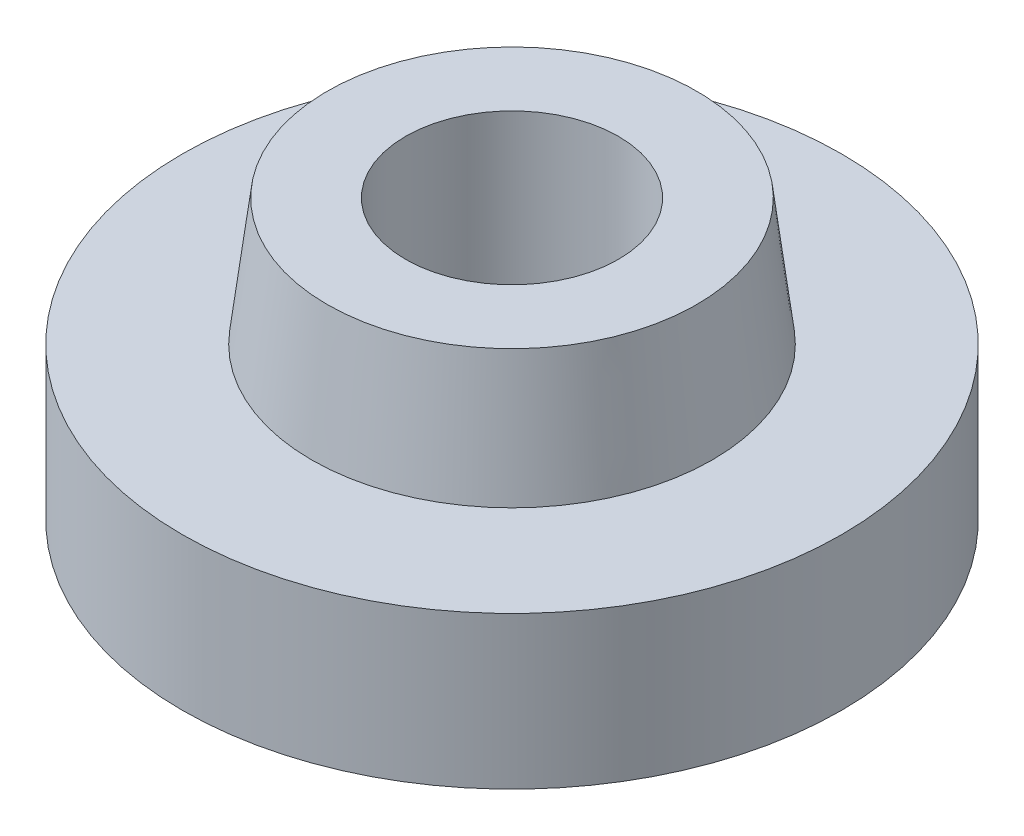
ISO-10303-21;
HEADER;
FILE_DESCRIPTION(('STEP AP214'),'2;1');
FILE_NAME('part.step','',(''),(''),'','','');
FILE_SCHEMA(('AUTOMOTIVE_DESIGN { 1 0 10303 214 1 1 1 1 }'));
ENDSEC;
DATA;
#1=APPLICATION_CONTEXT('core data for automotive mechanical design processes');
#2=APPLICATION_PROTOCOL_DEFINITION('international standard','automotive_design',2000,#1);
#3=PRODUCT_CONTEXT('',#1,'mechanical');
#4=PRODUCT('Part','Part','',(#3));
#5=PRODUCT_RELATED_PRODUCT_CATEGORY('part','',(#4));
#6=PRODUCT_DEFINITION_FORMATION('','',#4);
#7=PRODUCT_DEFINITION_CONTEXT('part definition',#1,'design');
#8=PRODUCT_DEFINITION('design','',#6,#7);
#9=PRODUCT_DEFINITION_SHAPE('','',#8);
#10=(LENGTH_UNIT() NAMED_UNIT(*) SI_UNIT(.MILLI.,.METRE.));
#11=(NAMED_UNIT(*) PLANE_ANGLE_UNIT() SI_UNIT($,.RADIAN.));
#12=(NAMED_UNIT(*) SI_UNIT($,.STERADIAN.) SOLID_ANGLE_UNIT());
#13=UNCERTAINTY_MEASURE_WITH_UNIT(LENGTH_MEASURE(1.E-05),#10,'distance_accuracy_value','');
#14=(GEOMETRIC_REPRESENTATION_CONTEXT(3) GLOBAL_UNCERTAINTY_ASSIGNED_CONTEXT((#13)) GLOBAL_UNIT_ASSIGNED_CONTEXT((#10,
#11,#12)) REPRESENTATION_CONTEXT('',''));
#15=CARTESIAN_POINT('',(0.,0.,0.));
#16=DIRECTION('',(0.,0.,1.));
#17=DIRECTION('',(1.,0.,0.));
#18=AXIS2_PLACEMENT_3D('',#15,#16,#17);
#19=CARTESIAN_POINT('',(0.,2.5,0.));
#20=DIRECTION('',(0.,1.,0.));
#21=DIRECTION('',(0.,0.,1.));
#22=AXIS2_PLACEMENT_3D('',#19,#20,#21);
#23=PLANE('',#22);
#24=CARTESIAN_POINT('',(0.,2.5,0.));
#25=DIRECTION('',(0.,1.,0.));
#26=DIRECTION('',(0.,0.,1.));
#27=AXIS2_PLACEMENT_3D('',#24,#25,#26);
#28=CIRCLE('',#27,3.64303859774274);
#29=CARTESIAN_POINT('',(0.,2.5,3.64303859774274));
#30=VERTEX_POINT('',#29);
#31=EDGE_CURVE('E10',#30,#30,#28,.T.);
#32=ORIENTED_EDGE('',*,*,#31,.T.);
#33=EDGE_LOOP('',(#32));
#34=FACE_BOUND('',#33,.T.);
#35=CARTESIAN_POINT('',(0.,2.5,0.));
#36=DIRECTION('',(0.,1.,0.));
#37=DIRECTION('',(0.,0.,1.));
#38=AXIS2_PLACEMENT_3D('',#35,#36,#37);
#39=CIRCLE('',#38,2.1);
#40=CARTESIAN_POINT('',(0.,2.5,2.1));
#41=VERTEX_POINT('',#40);
#42=EDGE_CURVE('E47',#41,#41,#39,.T.);
#43=ORIENTED_EDGE('',*,*,#42,.F.);
#44=EDGE_LOOP('',(#43));
#45=FACE_BOUND('',#44,.T.);
#46=ADVANCED_FACE('F39',(#34,#45),#23,.T.);
#47=CARTESIAN_POINT('',(0.,2.5,0.));
#48=DIRECTION('',(0.,-1.,0.));
#49=DIRECTION('',(0.,0.,-1.));
#50=AXIS2_PLACEMENT_3D('',#47,#48,#49);
#51=CYLINDRICAL_SURFACE('',#50,2.1);
#52=ORIENTED_EDGE('',*,*,#42,.T.);
#53=EDGE_LOOP('',(#52));
#54=FACE_BOUND('',#53,.T.);
#55=CARTESIAN_POINT('',(0.,-3.,0.));
#56=DIRECTION('',(0.,-1.,0.));
#57=DIRECTION('',(0.,0.,-1.));
#58=AXIS2_PLACEMENT_3D('',#55,#56,#57);
#59=CIRCLE('',#58,2.1);
#60=CARTESIAN_POINT('',(0.,-3.,-2.1));
#61=VERTEX_POINT('',#60);
#62=EDGE_CURVE('E61',#61,#61,#59,.T.);
#63=ORIENTED_EDGE('',*,*,#62,.T.);
#64=EDGE_LOOP('',(#63));
#65=FACE_BOUND('',#64,.T.);
#66=ADVANCED_FACE('F67',(#54,#65),#51,.F.);
#67=CARTESIAN_POINT('',(0.,-3.,0.));
#68=DIRECTION('',(0.,-1.,0.));
#69=DIRECTION('',(0.,0.,-1.));
#70=AXIS2_PLACEMENT_3D('',#67,#68,#69);
#71=PLANE('',#70);
#72=CARTESIAN_POINT('',(0.,-3.,0.));
#73=DIRECTION('',(0.,-1.,0.));
#74=DIRECTION('',(0.,0.,-1.));
#75=AXIS2_PLACEMENT_3D('',#72,#73,#74);
#76=CIRCLE('',#75,6.5);
#77=CARTESIAN_POINT('',(0.,-3.,-6.5));
#78=VERTEX_POINT('',#77);
#79=EDGE_CURVE('E56',#78,#78,#76,.T.);
#80=ORIENTED_EDGE('',*,*,#79,.T.);
#81=EDGE_LOOP('',(#80));
#82=FACE_BOUND('',#81,.T.);
#83=ORIENTED_EDGE('',*,*,#62,.F.);
#84=EDGE_LOOP('',(#83));
#85=FACE_BOUND('',#84,.T.);
#86=ADVANCED_FACE('F69',(#82,#85),#71,.T.);
#87=CARTESIAN_POINT('',(0.,0.,0.));
#88=DIRECTION('',(0.,-1.,0.));
#89=DIRECTION('',(0.,0.,-1.));
#90=AXIS2_PLACEMENT_3D('',#87,#88,#89);
#91=PLANE('',#90);
#92=CARTESIAN_POINT('',(0.,0.,0.));
#93=DIRECTION('',(0.,1.,0.));
#94=DIRECTION('',(0.,0.,1.));
#95=AXIS2_PLACEMENT_3D('',#92,#93,#94);
#96=CIRCLE('',#95,3.95);
#97=CARTESIAN_POINT('',(0.,0.,3.95));
#98=VERTEX_POINT('',#97);
#99=EDGE_CURVE('E51',#98,#98,#96,.T.);
#100=ORIENTED_EDGE('',*,*,#99,.F.);
#101=EDGE_LOOP('',(#100));
#102=FACE_BOUND('',#101,.T.);
#103=CARTESIAN_POINT('',(0.,0.,0.));
#104=DIRECTION('',(0.,-1.,0.));
#105=DIRECTION('',(0.,0.,-1.));
#106=AXIS2_PLACEMENT_3D('',#103,#104,#105);
#107=CIRCLE('',#106,6.5);
#108=CARTESIAN_POINT('',(0.,0.,-6.5));
#109=VERTEX_POINT('',#108);
#110=EDGE_CURVE('E58',#109,#109,#107,.T.);
#111=ORIENTED_EDGE('',*,*,#110,.F.);
#112=EDGE_LOOP('',(#111));
#113=FACE_BOUND('',#112,.T.);
#114=ADVANCED_FACE('F71',(#102,#113),#91,.F.);
#115=CARTESIAN_POINT('',(0.,-3.,0.));
#116=DIRECTION('',(0.,1.,0.));
#117=DIRECTION('',(0.,0.,1.));
#118=AXIS2_PLACEMENT_3D('',#115,#116,#117);
#119=CYLINDRICAL_SURFACE('',#118,6.5);
#120=ORIENTED_EDGE('',*,*,#79,.F.);
#121=EDGE_LOOP('',(#120));
#122=FACE_BOUND('',#121,.T.);
#123=ORIENTED_EDGE('',*,*,#110,.T.);
#124=EDGE_LOOP('',(#123));
#125=FACE_BOUND('',#124,.T.);
#126=ADVANCED_FACE('F78',(#122,#125),#119,.T.);
#127=CARTESIAN_POINT('',(0.,2.5,0.));
#128=DIRECTION('',(0.,-1.,0.));
#129=DIRECTION('',(0.,0.,-1.));
#130=AXIS2_PLACEMENT_3D('',#127,#128,#129);
#131=CONICAL_SURFACE('',#130,3.64303859774274,0.1221730476396);
#132=ORIENTED_EDGE('',*,*,#99,.T.);
#133=EDGE_LOOP('',(#132));
#134=FACE_BOUND('',#133,.T.);
#135=ORIENTED_EDGE('',*,*,#31,.F.);
#136=EDGE_LOOP('',(#135));
#137=FACE_BOUND('',#136,.T.);
#138=ADVANCED_FACE('F42',(#134,#137),#131,.T.);
#139=CLOSED_SHELL('',(#46,#66,#86,#114,#126,#138));
#140=MANIFOLD_SOLID_BREP('B2',#139);
#141=ADVANCED_BREP_SHAPE_REPRESENTATION('',(#18,#140),#14);
#142=SHAPE_DEFINITION_REPRESENTATION(#9,#141);
ENDSEC;
END-ISO-10303-21;
